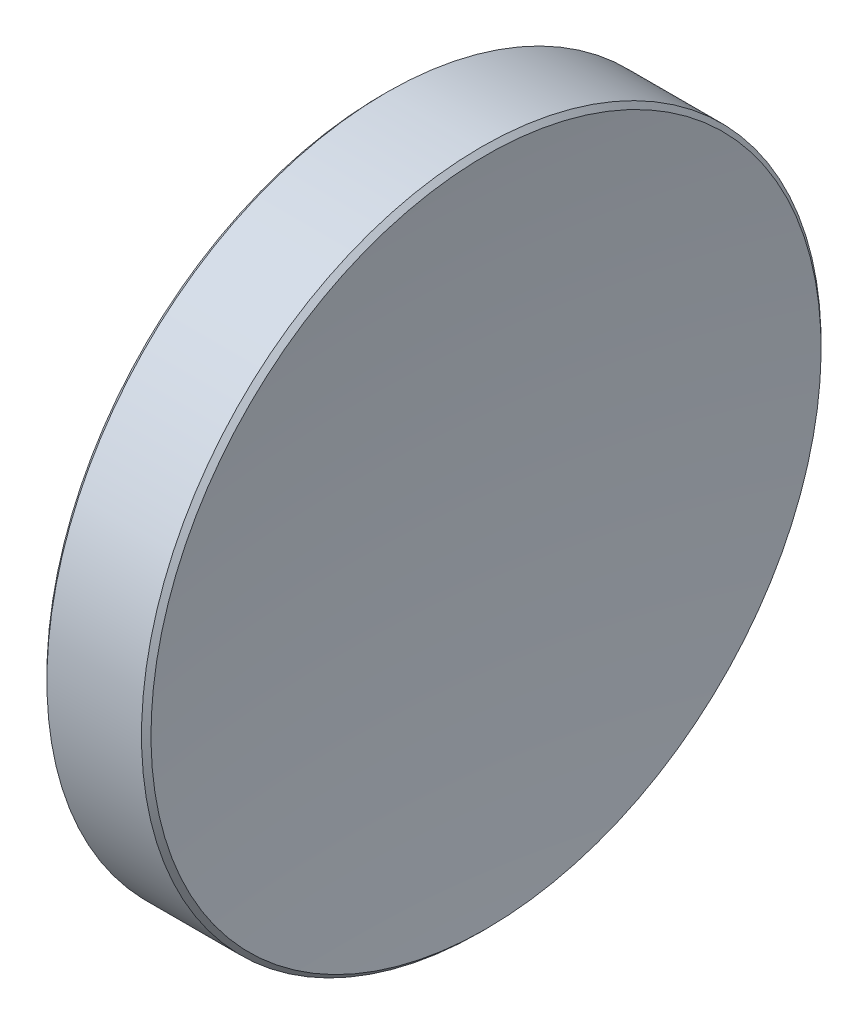
ISO-10303-21;
HEADER;
FILE_DESCRIPTION(('STEP AP214'),'2;1');
FILE_NAME('part.step','',(''),(''),'','','');
FILE_SCHEMA(('AUTOMOTIVE_DESIGN { 1 0 10303 214 1 1 1 1 }'));
ENDSEC;
DATA;
#1=APPLICATION_CONTEXT('core data for automotive mechanical design processes');
#2=APPLICATION_PROTOCOL_DEFINITION('international standard','automotive_design',2000,#1);
#3=PRODUCT_CONTEXT('',#1,'mechanical');
#4=PRODUCT('Part','Part','',(#3));
#5=PRODUCT_RELATED_PRODUCT_CATEGORY('part','',(#4));
#6=PRODUCT_DEFINITION_FORMATION('','',#4);
#7=PRODUCT_DEFINITION_CONTEXT('part definition',#1,'design');
#8=PRODUCT_DEFINITION('design','',#6,#7);
#9=PRODUCT_DEFINITION_SHAPE('','',#8);
#10=(LENGTH_UNIT() NAMED_UNIT(*) SI_UNIT(.MILLI.,.METRE.));
#11=(NAMED_UNIT(*) PLANE_ANGLE_UNIT() SI_UNIT($,.RADIAN.));
#12=(NAMED_UNIT(*) SI_UNIT($,.STERADIAN.) SOLID_ANGLE_UNIT());
#13=UNCERTAINTY_MEASURE_WITH_UNIT(LENGTH_MEASURE(1.E-05),#10,'distance_accuracy_value','');
#14=(GEOMETRIC_REPRESENTATION_CONTEXT(3) GLOBAL_UNCERTAINTY_ASSIGNED_CONTEXT((#13)) GLOBAL_UNIT_ASSIGNED_CONTEXT((#10,
#11,#12)) REPRESENTATION_CONTEXT('',''));
#15=CARTESIAN_POINT('',(0.,0.,0.));
#16=DIRECTION('',(0.,0.,1.));
#17=DIRECTION('',(1.,0.,0.));
#18=AXIS2_PLACEMENT_3D('',#15,#16,#17);
#19=CARTESIAN_POINT('',(198.248830503556,-0.683957023421869,0.));
#20=DIRECTION('',(0.,0.,-1.));
#21=DIRECTION('',(0.,-1.,0.));
#22=AXIS2_PLACEMENT_3D('',#19,#20,#21);
#23=CIRCLE('',#22,200.);
#24=TRIMMED_CURVE('',#23,(PARAMETER_VALUE(-1.57421611857773)),
(PARAMETER_VALUE(1.57421611857773)),.T.,.PARAMETER.);
#25=CARTESIAN_POINT('',(198.248830503556,0.,0.));
#26=DIRECTION('',(-1.,0.,0.));
#27=AXIS1_PLACEMENT('',#25,#26);
#28=SURFACE_OF_REVOLUTION('',#24,#27);
#29=CARTESIAN_POINT('',(-1.75,0.,0.));
#30=VERTEX_POINT('',#29);
#31=VERTEX_LOOP('',#30);
#32=FACE_BOUND('',#31,.T.);
#33=CARTESIAN_POINT('',(-1.40044140576232,0.,0.));
#34=DIRECTION('',(-1.,0.,0.));
#35=DIRECTION('',(0.,-1.,0.));
#36=AXIS2_PLACEMENT_3D('',#33,#34,#35);
#37=CIRCLE('',#36,12.5232233047034);
#38=CARTESIAN_POINT('',(-1.40044140576232,-12.5232233047034,0.));
#39=VERTEX_POINT('',#38);
#40=EDGE_CURVE('E10',#39,#39,#37,.T.);
#41=ORIENTED_EDGE('',*,*,#40,.T.);
#42=EDGE_LOOP('',(#41));
#43=FACE_BOUND('',#42,.T.);
#44=ADVANCED_FACE('F15',(#32,#43),#28,.T.);
#45=CARTESIAN_POINT('',(-1.22366471046569,0.,0.));
#46=DIRECTION('',(1.,0.,0.));
#47=DIRECTION('',(0.,1.,0.));
#48=AXIS2_PLACEMENT_3D('',#45,#46,#47);
#49=CONICAL_SURFACE('',#48,12.7,0.785398163397451);
#50=ORIENTED_EDGE('',*,*,#40,.F.);
#51=EDGE_LOOP('',(#50));
#52=FACE_BOUND('',#51,.T.);
#53=CARTESIAN_POINT('',(-1.22366471046569,0.,0.));
#54=DIRECTION('',(-1.,0.,0.));
#55=DIRECTION('',(0.,-1.,0.));
#56=AXIS2_PLACEMENT_3D('',#53,#54,#55);
#57=CIRCLE('',#56,12.7);
#58=CARTESIAN_POINT('',(-1.22366471046568,-12.7,0.));
#59=VERTEX_POINT('',#58);
#60=EDGE_CURVE('E21',#59,#59,#57,.T.);
#61=ORIENTED_EDGE('',*,*,#60,.T.);
#62=EDGE_LOOP('',(#61));
#63=FACE_BOUND('',#62,.T.);
#64=ADVANCED_FACE('F26',(#52,#63),#49,.T.);
#65=CARTESIAN_POINT('',(-1.75,0.,0.));
#66=DIRECTION('',(-1.,0.,0.));
#67=DIRECTION('',(0.,-1.,0.));
#68=AXIS2_PLACEMENT_3D('',#65,#66,#67);
#69=CYLINDRICAL_SURFACE('',#68,12.7);
#70=ORIENTED_EDGE('',*,*,#60,.F.);
#71=EDGE_LOOP('',(#70));
#72=FACE_BOUND('',#71,.T.);
#73=CARTESIAN_POINT('',(2.31278189894104,0.,0.));
#74=DIRECTION('',(-1.,0.,0.));
#75=DIRECTION('',(0.,-1.,0.));
#76=AXIS2_PLACEMENT_3D('',#73,#74,#75);
#77=CIRCLE('',#76,12.7);
#78=CARTESIAN_POINT('',(2.31278189894104,-12.7,0.));
#79=VERTEX_POINT('',#78);
#80=EDGE_CURVE('E35',#79,#79,#77,.T.);
#81=ORIENTED_EDGE('',*,*,#80,.T.);
#82=EDGE_LOOP('',(#81));
#83=FACE_BOUND('',#82,.T.);
#84=ADVANCED_FACE('F31',(#72,#83),#69,.T.);
#85=CARTESIAN_POINT('',(2.48955859423768,0.,0.));
#86=DIRECTION('',(-1.,0.,0.));
#87=DIRECTION('',(0.,-1.,0.));
#88=AXIS2_PLACEMENT_3D('',#85,#86,#87);
#89=CONICAL_SURFACE('',#88,12.5232233047034,0.785398163397448);
#90=ORIENTED_EDGE('',*,*,#80,.F.);
#91=EDGE_LOOP('',(#90));
#92=FACE_BOUND('',#91,.T.);
#93=CARTESIAN_POINT('',(2.48955859423768,0.,0.));
#94=DIRECTION('',(-1.,0.,0.));
#95=DIRECTION('',(0.,-1.,0.));
#96=AXIS2_PLACEMENT_3D('',#93,#94,#95);
#97=CIRCLE('',#96,12.5232233047034);
#98=CARTESIAN_POINT('',(2.48955859423768,-12.5232233047034,0.));
#99=VERTEX_POINT('',#98);
#100=EDGE_CURVE('E37',#99,#99,#97,.T.);
#101=ORIENTED_EDGE('',*,*,#100,.T.);
#102=EDGE_LOOP('',(#101));
#103=FACE_BOUND('',#102,.T.);
#104=ADVANCED_FACE('F43',(#92,#103),#89,.T.);
#105=CARTESIAN_POINT('',(108.15,0.,0.));
#106=DIRECTION('',(-1.,0.,0.));
#107=DIRECTION('',(0.,-1.,0.));
#108=AXIS2_PLACEMENT_3D('',#105,#106,#107);
#109=SPHERICAL_SURFACE('',#108,106.4);
#110=ORIENTED_EDGE('',*,*,#100,.F.);
#111=EDGE_LOOP('',(#110));
#112=FACE_BOUND('',#111,.T.);
#113=ADVANCED_FACE('F45',(#112),#109,.F.);
#114=CLOSED_SHELL('',(#44,#64,#84,#104,#113));
#115=MANIFOLD_SOLID_BREP('B1',#114);
#116=ADVANCED_BREP_SHAPE_REPRESENTATION('',(#18,#115),#14);
#117=SHAPE_DEFINITION_REPRESENTATION(#9,#116);
ENDSEC;
END-ISO-10303-21;
